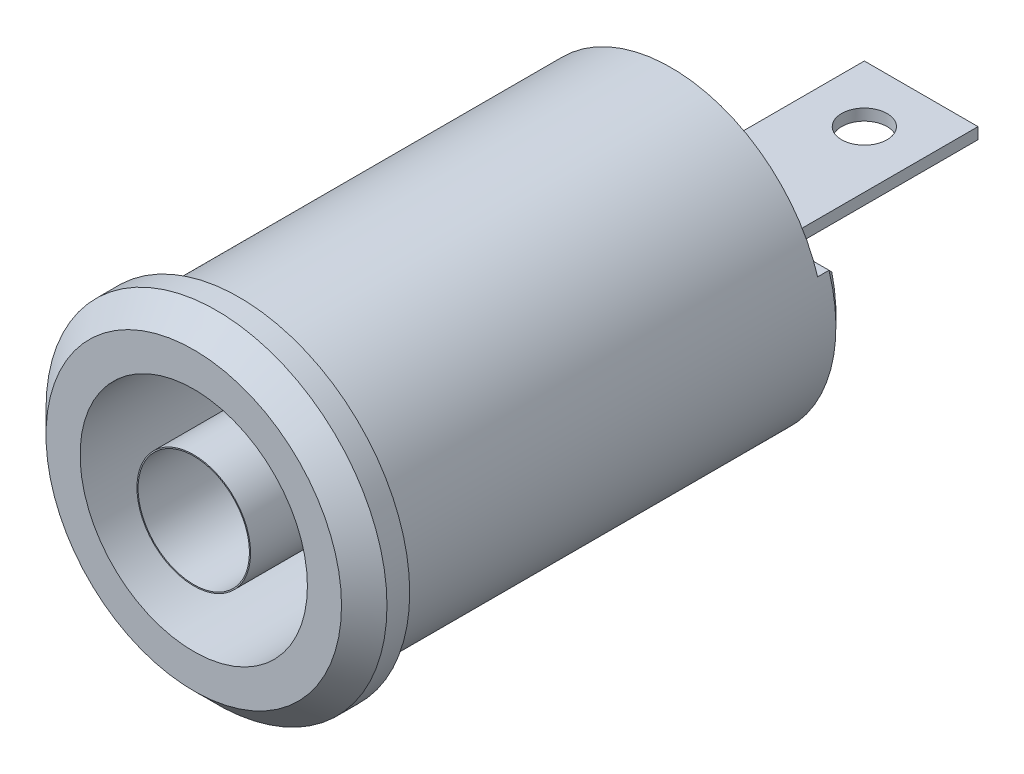
ISO-10303-21;
HEADER;
FILE_DESCRIPTION(('STEP AP214'),'2;1');
FILE_NAME('part.step','',(''),(''),'','','');
FILE_SCHEMA(('AUTOMOTIVE_DESIGN { 1 0 10303 214 1 1 1 1 }'));
ENDSEC;
DATA;
#1=APPLICATION_CONTEXT('core data for automotive mechanical design processes');
#2=APPLICATION_PROTOCOL_DEFINITION('international standard','automotive_design',2000,#1);
#3=PRODUCT_CONTEXT('',#1,'mechanical');
#4=PRODUCT('Part','Part','',(#3));
#5=PRODUCT_RELATED_PRODUCT_CATEGORY('part','',(#4));
#6=PRODUCT_DEFINITION_FORMATION('','',#4);
#7=PRODUCT_DEFINITION_CONTEXT('part definition',#1,'design');
#8=PRODUCT_DEFINITION('design','',#6,#7);
#9=PRODUCT_DEFINITION_SHAPE('','',#8);
#10=(LENGTH_UNIT() NAMED_UNIT(*) SI_UNIT(.MILLI.,.METRE.));
#11=(NAMED_UNIT(*) PLANE_ANGLE_UNIT() SI_UNIT($,.RADIAN.));
#12=(NAMED_UNIT(*) SI_UNIT($,.STERADIAN.) SOLID_ANGLE_UNIT());
#13=UNCERTAINTY_MEASURE_WITH_UNIT(LENGTH_MEASURE(1.E-05),#10,'distance_accuracy_value','');
#14=(GEOMETRIC_REPRESENTATION_CONTEXT(3) GLOBAL_UNCERTAINTY_ASSIGNED_CONTEXT((#13)) GLOBAL_UNIT_ASSIGNED_CONTEXT((#10,
#11,#12)) REPRESENTATION_CONTEXT('',''));
#15=CARTESIAN_POINT('',(0.,0.,0.));
#16=DIRECTION('',(0.,0.,1.));
#17=DIRECTION('',(1.,0.,0.));
#18=AXIS2_PLACEMENT_3D('',#15,#16,#17);
#19=CARTESIAN_POINT('',(0.,0.,-2.));
#20=DIRECTION('',(0.,0.,-1.));
#21=DIRECTION('',(-1.,0.,0.));
#22=AXIS2_PLACEMENT_3D('',#19,#20,#21);
#23=CYLINDRICAL_SURFACE('',#22,6.75);
#24=DIRECTION('',(0.,0.,-1.));
#25=VECTOR('',#24,1.);
#26=CARTESIAN_POINT('',(-6.44689847911381,2.,-2.));
#27=LINE('',#26,#25);
#28=CARTESIAN_POINT('',(-6.44689847911381,2.,-21.5));
#29=VERTEX_POINT('',#28);
#30=CARTESIAN_POINT('',(-6.44689847911381,2.,-21.));
#31=VERTEX_POINT('',#30);
#32=EDGE_CURVE('E116',#29,#31,#27,.F.);
#33=ORIENTED_EDGE('',*,*,#32,.F.);
#34=CARTESIAN_POINT('',(0.,0.,-21.5));
#35=DIRECTION('',(0.,0.,-1.));
#36=DIRECTION('',(-1.,0.,0.));
#37=AXIS2_PLACEMENT_3D('',#34,#35,#36);
#38=CIRCLE('',#37,6.75);
#39=CARTESIAN_POINT('',(6.44689847911381,2.,-21.5));
#40=VERTEX_POINT('',#39);
#41=EDGE_CURVE('E121',#29,#40,#38,.F.);
#42=ORIENTED_EDGE('',*,*,#41,.T.);
#43=DIRECTION('',(0.,0.,-1.));
#44=VECTOR('',#43,1.);
#45=CARTESIAN_POINT('',(6.44689847911381,2.,-2.));
#46=LINE('',#45,#44);
#47=CARTESIAN_POINT('',(6.44689847911381,2.,-21.));
#48=VERTEX_POINT('',#47);
#49=EDGE_CURVE('E115',#48,#40,#46,.T.);
#50=ORIENTED_EDGE('',*,*,#49,.F.);
#51=CARTESIAN_POINT('',(0.,0.,-21.));
#52=DIRECTION('',(0.,0.,-1.));
#53=DIRECTION('',(-1.,0.,0.));
#54=AXIS2_PLACEMENT_3D('',#51,#52,#53);
#55=CIRCLE('',#54,6.75);
#56=EDGE_CURVE('E102',#48,#31,#55,.F.);
#57=ORIENTED_EDGE('',*,*,#56,.T.);
#58=EDGE_LOOP('',(#33,#42,#50,#57));
#59=FACE_BOUND('',#58,.T.);
#60=CARTESIAN_POINT('',(0.,0.,-2.));
#61=DIRECTION('',(0.,0.,-1.));
#62=DIRECTION('',(-1.,0.,0.));
#63=AXIS2_PLACEMENT_3D('',#60,#61,#62);
#64=CIRCLE('',#63,6.75);
#65=CARTESIAN_POINT('',(-6.75,0.,-2.));
#66=VERTEX_POINT('',#65);
#67=EDGE_CURVE('E153',#66,#66,#64,.T.);
#68=ORIENTED_EDGE('',*,*,#67,.T.);
#69=EDGE_LOOP('',(#68));
#70=FACE_BOUND('',#69,.T.);
#71=ADVANCED_FACE('F38',(#59,#70),#23,.T.);
#72=CARTESIAN_POINT('',(0.,0.,-32.));
#73=DIRECTION('',(0.,0.,1.));
#74=DIRECTION('',(1.,0.,0.));
#75=AXIS2_PLACEMENT_3D('',#72,#73,#74);
#76=CYLINDRICAL_SURFACE('',#75,7.5);
#77=CARTESIAN_POINT('',(0.,0.,-1.));
#78=DIRECTION('',(0.,0.,1.));
#79=DIRECTION('',(1.,0.,0.));
#80=AXIS2_PLACEMENT_3D('',#77,#78,#79);
#81=CIRCLE('',#80,7.5);
#82=CARTESIAN_POINT('',(7.5,0.,-1.));
#83=VERTEX_POINT('',#82);
#84=EDGE_CURVE('E187',#83,#83,#81,.F.);
#85=ORIENTED_EDGE('',*,*,#84,.T.);
#86=EDGE_LOOP('',(#85));
#87=FACE_BOUND('',#86,.T.);
#88=CARTESIAN_POINT('',(0.,0.,-2.));
#89=DIRECTION('',(0.,0.,-1.));
#90=DIRECTION('',(-1.,0.,0.));
#91=AXIS2_PLACEMENT_3D('',#88,#89,#90);
#92=CIRCLE('',#91,7.5);
#93=CARTESIAN_POINT('',(-7.5,0.,-2.));
#94=VERTEX_POINT('',#93);
#95=EDGE_CURVE('E162',#94,#94,#92,.F.);
#96=ORIENTED_EDGE('',*,*,#95,.T.);
#97=EDGE_LOOP('',(#96));
#98=FACE_BOUND('',#97,.T.);
#99=ADVANCED_FACE('F207',(#87,#98),#76,.T.);
#100=CARTESIAN_POINT('',(0.,0.,0.));
#101=DIRECTION('',(0.,0.,1.));
#102=DIRECTION('',(1.,0.,0.));
#103=AXIS2_PLACEMENT_3D('',#100,#101,#102);
#104=PLANE('',#103);
#105=CARTESIAN_POINT('',(0.,0.,0.));
#106=DIRECTION('',(0.,0.,1.));
#107=DIRECTION('',(1.,0.,0.));
#108=AXIS2_PLACEMENT_3D('',#105,#106,#107);
#109=CIRCLE('',#108,6.5);
#110=CARTESIAN_POINT('',(6.5,0.,0.));
#111=VERTEX_POINT('',#110);
#112=EDGE_CURVE('E109',#111,#111,#109,.T.);
#113=ORIENTED_EDGE('',*,*,#112,.T.);
#114=EDGE_LOOP('',(#113));
#115=FACE_BOUND('',#114,.T.);
#116=CARTESIAN_POINT('',(0.,0.,0.));
#117=DIRECTION('',(0.,0.,1.));
#118=DIRECTION('',(1.,0.,0.));
#119=AXIS2_PLACEMENT_3D('',#116,#117,#118);
#120=CIRCLE('',#119,5.);
#121=CARTESIAN_POINT('',(5.,0.,0.));
#122=VERTEX_POINT('',#121);
#123=EDGE_CURVE('E173',#122,#122,#120,.T.);
#124=ORIENTED_EDGE('',*,*,#123,.F.);
#125=EDGE_LOOP('',(#124));
#126=FACE_BOUND('',#125,.T.);
#127=ADVANCED_FACE('F210',(#115,#126),#104,.T.);
#128=CARTESIAN_POINT('',(0.,0.,-18.));
#129=DIRECTION('',(0.,0.,1.));
#130=DIRECTION('',(1.,0.,0.));
#131=AXIS2_PLACEMENT_3D('',#128,#129,#130);
#132=CYLINDRICAL_SURFACE('',#131,2.5);
#133=CARTESIAN_POINT('',(0.,0.,-18.));
#134=DIRECTION('',(0.,0.,1.));
#135=DIRECTION('',(1.,0.,0.));
#136=AXIS2_PLACEMENT_3D('',#133,#134,#135);
#137=CIRCLE('',#136,2.5);
#138=CARTESIAN_POINT('',(2.5,0.,-18.));
#139=VERTEX_POINT('',#138);
#140=EDGE_CURVE('E170',#139,#139,#137,.T.);
#141=ORIENTED_EDGE('',*,*,#140,.T.);
#142=EDGE_LOOP('',(#141));
#143=FACE_BOUND('',#142,.T.);
#144=CARTESIAN_POINT('',(0.,0.,0.));
#145=DIRECTION('',(0.,0.,1.));
#146=DIRECTION('',(1.,0.,0.));
#147=AXIS2_PLACEMENT_3D('',#144,#145,#146);
#148=CIRCLE('',#147,2.5);
#149=CARTESIAN_POINT('',(2.5,0.,0.));
#150=VERTEX_POINT('',#149);
#151=EDGE_CURVE('E166',#150,#150,#148,.T.);
#152=ORIENTED_EDGE('',*,*,#151,.F.);
#153=EDGE_LOOP('',(#152));
#154=FACE_BOUND('',#153,.T.);
#155=ADVANCED_FACE('F214',(#143,#154),#132,.T.);
#156=CARTESIAN_POINT('',(0.,0.,-18.));
#157=DIRECTION('',(0.,0.,1.));
#158=DIRECTION('',(1.,0.,0.));
#159=AXIS2_PLACEMENT_3D('',#156,#157,#158);
#160=CYLINDRICAL_SURFACE('',#159,5.);
#161=CARTESIAN_POINT('',(0.,0.,-18.));
#162=DIRECTION('',(0.,0.,1.));
#163=DIRECTION('',(1.,0.,0.));
#164=AXIS2_PLACEMENT_3D('',#161,#162,#163);
#165=CIRCLE('',#164,5.);
#166=CARTESIAN_POINT('',(5.,0.,-18.));
#167=VERTEX_POINT('',#166);
#168=EDGE_CURVE('E110',#167,#167,#165,.T.);
#169=ORIENTED_EDGE('',*,*,#168,.F.);
#170=EDGE_LOOP('',(#169));
#171=FACE_BOUND('',#170,.T.);
#172=ORIENTED_EDGE('',*,*,#123,.T.);
#173=EDGE_LOOP('',(#172));
#174=FACE_BOUND('',#173,.T.);
#175=ADVANCED_FACE('F224',(#171,#174),#160,.F.);
#176=CARTESIAN_POINT('',(0.,-16.6414213562373,-18.));
#177=DIRECTION('',(0.,0.,1.));
#178=DIRECTION('',(1.,0.,0.));
#179=AXIS2_PLACEMENT_3D('',#176,#177,#178);
#180=PLANE('',#179);
#181=ORIENTED_EDGE('',*,*,#140,.F.);
#182=EDGE_LOOP('',(#181));
#183=FACE_BOUND('',#182,.T.);
#184=ORIENTED_EDGE('',*,*,#168,.T.);
#185=EDGE_LOOP('',(#184));
#186=FACE_BOUND('',#185,.T.);
#187=ADVANCED_FACE('F228',(#183,#186),#180,.T.);
#188=CARTESIAN_POINT('',(0.,0.,0.));
#189=DIRECTION('',(0.,0.,1.));
#190=DIRECTION('',(1.,0.,0.));
#191=AXIS2_PLACEMENT_3D('',#188,#189,#190);
#192=CIRCLE('',#191,2.45);
#193=CARTESIAN_POINT('',(2.45,0.,0.));
#194=VERTEX_POINT('',#193);
#195=EDGE_CURVE('E167',#194,#194,#192,.T.);
#196=ORIENTED_EDGE('',*,*,#195,.F.);
#197=EDGE_LOOP('',(#196));
#198=FACE_BOUND('',#197,.T.);
#199=ORIENTED_EDGE('',*,*,#151,.T.);
#200=EDGE_LOOP('',(#199));
#201=FACE_BOUND('',#200,.T.);
#202=ADVANCED_FACE('F216',(#198,#201),#104,.T.);
#203=CARTESIAN_POINT('',(0.,0.,-18.));
#204=DIRECTION('',(0.,0.,1.));
#205=DIRECTION('',(1.,0.,0.));
#206=AXIS2_PLACEMENT_3D('',#203,#204,#205);
#207=CYLINDRICAL_SURFACE('',#206,2.45);
#208=CARTESIAN_POINT('',(0.,0.,-18.));
#209=DIRECTION('',(0.,0.,1.));
#210=DIRECTION('',(1.,0.,0.));
#211=AXIS2_PLACEMENT_3D('',#208,#209,#210);
#212=CIRCLE('',#211,2.45);
#213=CARTESIAN_POINT('',(2.45,0.,-18.));
#214=VERTEX_POINT('',#213);
#215=EDGE_CURVE('E163',#214,#214,#212,.T.);
#216=ORIENTED_EDGE('',*,*,#215,.F.);
#217=EDGE_LOOP('',(#216));
#218=FACE_BOUND('',#217,.T.);
#219=ORIENTED_EDGE('',*,*,#195,.T.);
#220=EDGE_LOOP('',(#219));
#221=FACE_BOUND('',#220,.T.);
#222=ADVANCED_FACE('F233',(#218,#221),#207,.F.);
#223=CARTESIAN_POINT('',(0.,-16.6414213562373,-18.));
#224=DIRECTION('',(0.,0.,1.));
#225=DIRECTION('',(1.,0.,0.));
#226=AXIS2_PLACEMENT_3D('',#223,#224,#225);
#227=PLANE('',#226);
#228=ORIENTED_EDGE('',*,*,#215,.T.);
#229=EDGE_LOOP('',(#228));
#230=FACE_BOUND('',#229,.T.);
#231=ADVANCED_FACE('F236',(#230),#227,.T.);
#232=CARTESIAN_POINT('',(0.,0.,-2.));
#233=DIRECTION('',(0.,0.,-1.));
#234=DIRECTION('',(-1.,0.,0.));
#235=AXIS2_PLACEMENT_3D('',#232,#233,#234);
#236=PLANE('',#235);
#237=ORIENTED_EDGE('',*,*,#95,.F.);
#238=EDGE_LOOP('',(#237));
#239=FACE_BOUND('',#238,.T.);
#240=ORIENTED_EDGE('',*,*,#67,.F.);
#241=EDGE_LOOP('',(#240));
#242=FACE_BOUND('',#241,.T.);
#243=ADVANCED_FACE('F240',(#239,#242),#236,.T.);
#244=CARTESIAN_POINT('',(-0.025564170509286,-0.127820852546322,-22.));
#245=DIRECTION('',(0.,0.,-1.));
#246=DIRECTION('',(-1.,0.,0.));
#247=AXIS2_PLACEMENT_3D('',#244,#245,#246);
#248=PLANE('',#247);
#249=DIRECTION('',(1.,0.,0.));
#250=VECTOR('',#249,1.);
#251=CARTESIAN_POINT('',(6.44689847911381,1.5,-22.));
#252=LINE('',#251,#250);
#253=CARTESIAN_POINT('',(-6.0673305497558,1.5,-22.));
#254=VERTEX_POINT('',#253);
#255=CARTESIAN_POINT('',(6.0673305497558,1.5,-22.));
#256=VERTEX_POINT('',#255);
#257=EDGE_CURVE('E58',#254,#256,#252,.T.);
#258=ORIENTED_EDGE('',*,*,#257,.T.);
#259=CARTESIAN_POINT('',(0.,0.,-22.));
#260=DIRECTION('',(0.,0.,-1.));
#261=DIRECTION('',(-1.,0.,0.));
#262=AXIS2_PLACEMENT_3D('',#259,#260,#261);
#263=CIRCLE('',#262,6.25);
#264=EDGE_CURVE('E51',#256,#254,#263,.T.);
#265=ORIENTED_EDGE('',*,*,#264,.T.);
#266=EDGE_LOOP('',(#258,#265));
#267=FACE_BOUND('',#266,.T.);
#268=DIRECTION('',(1.,0.,0.));
#269=VECTOR('',#268,1.);
#270=CARTESIAN_POINT('',(2.5,0.249999999999999,-22.));
#271=LINE('',#270,#269);
#272=CARTESIAN_POINT('',(-2.5,0.249999999999999,-22.));
#273=VERTEX_POINT('',#272);
#274=CARTESIAN_POINT('',(2.5,0.249999999999999,-22.));
#275=VERTEX_POINT('',#274);
#276=EDGE_CURVE('E137',#273,#275,#271,.T.);
#277=ORIENTED_EDGE('',*,*,#276,.F.);
#278=DIRECTION('',(0.,1.,0.));
#279=VECTOR('',#278,1.);
#280=CARTESIAN_POINT('',(-2.5,0.249999999999999,-22.));
#281=LINE('',#280,#279);
#282=CARTESIAN_POINT('',(-2.5,-0.250000000000001,-22.));
#283=VERTEX_POINT('',#282);
#284=EDGE_CURVE('E134',#283,#273,#281,.T.);
#285=ORIENTED_EDGE('',*,*,#284,.F.);
#286=DIRECTION('',(-1.,0.,0.));
#287=VECTOR('',#286,1.);
#288=CARTESIAN_POINT('',(2.5,-0.250000000000001,-22.));
#289=LINE('',#288,#287);
#290=CARTESIAN_POINT('',(2.5,-0.250000000000001,-22.));
#291=VERTEX_POINT('',#290);
#292=EDGE_CURVE('E130',#291,#283,#289,.T.);
#293=ORIENTED_EDGE('',*,*,#292,.F.);
#294=DIRECTION('',(0.,-1.,0.));
#295=VECTOR('',#294,1.);
#296=CARTESIAN_POINT('',(2.5,0.249999999999999,-22.));
#297=LINE('',#296,#295);
#298=EDGE_CURVE('E127',#275,#291,#297,.T.);
#299=ORIENTED_EDGE('',*,*,#298,.F.);
#300=EDGE_LOOP('',(#277,#285,#293,#299));
#301=FACE_BOUND('',#300,.T.);
#302=ADVANCED_FACE('F244',(#267,#301),#248,.T.);
#303=CARTESIAN_POINT('',(2.5,0.249999999999999,-22.));
#304=DIRECTION('',(1.,0.,0.));
#305=DIRECTION('',(0.,0.,-1.));
#306=AXIS2_PLACEMENT_3D('',#303,#304,#305);
#307=PLANE('',#306);
#308=DIRECTION('',(0.,-1.,0.));
#309=VECTOR('',#308,1.);
#310=CARTESIAN_POINT('',(2.5,0.249999999999999,-32.));
#311=LINE('',#310,#309);
#312=CARTESIAN_POINT('',(2.5,0.249999999999999,-32.));
#313=VERTEX_POINT('',#312);
#314=CARTESIAN_POINT('',(2.5,-0.250000000000001,-32.));
#315=VERTEX_POINT('',#314);
#316=EDGE_CURVE('E123',#313,#315,#311,.T.);
#317=ORIENTED_EDGE('',*,*,#316,.F.);
#318=DIRECTION('',(0.,0.,-1.));
#319=VECTOR('',#318,1.);
#320=CARTESIAN_POINT('',(2.5,0.249999999999999,-22.));
#321=LINE('',#320,#319);
#322=EDGE_CURVE('E151',#275,#313,#321,.T.);
#323=ORIENTED_EDGE('',*,*,#322,.F.);
#324=ORIENTED_EDGE('',*,*,#298,.T.);
#325=DIRECTION('',(0.,0.,-1.));
#326=VECTOR('',#325,1.);
#327=CARTESIAN_POINT('',(2.5,-0.250000000000001,-22.));
#328=LINE('',#327,#326);
#329=EDGE_CURVE('E140',#291,#315,#328,.T.);
#330=ORIENTED_EDGE('',*,*,#329,.T.);
#331=EDGE_LOOP('',(#317,#323,#324,#330));
#332=FACE_BOUND('',#331,.T.);
#333=ADVANCED_FACE('F250',(#332),#307,.T.);
#334=CARTESIAN_POINT('',(2.5,0.249999999999999,-22.));
#335=DIRECTION('',(0.,1.,0.));
#336=DIRECTION('',(0.,0.,1.));
#337=AXIS2_PLACEMENT_3D('',#334,#335,#336);
#338=PLANE('',#337);
#339=CARTESIAN_POINT('',(0.,0.249999999999999,-29.5));
#340=DIRECTION('',(0.,1.,0.));
#341=DIRECTION('',(0.,0.,1.));
#342=AXIS2_PLACEMENT_3D('',#339,#340,#341);
#343=CIRCLE('',#342,1.);
#344=CARTESIAN_POINT('',(0.,0.249999999999999,-28.5));
#345=VERTEX_POINT('',#344);
#346=EDGE_CURVE('E184',#345,#345,#343,.T.);
#347=ORIENTED_EDGE('',*,*,#346,.F.);
#348=EDGE_LOOP('',(#347));
#349=FACE_BOUND('',#348,.T.);
#350=DIRECTION('',(1.,0.,0.));
#351=VECTOR('',#350,1.);
#352=CARTESIAN_POINT('',(2.5,0.249999999999999,-32.));
#353=LINE('',#352,#351);
#354=CARTESIAN_POINT('',(-2.5,0.249999999999999,-32.));
#355=VERTEX_POINT('',#354);
#356=EDGE_CURVE('E131',#355,#313,#353,.T.);
#357=ORIENTED_EDGE('',*,*,#356,.F.);
#358=DIRECTION('',(0.,0.,-1.));
#359=VECTOR('',#358,1.);
#360=CARTESIAN_POINT('',(-2.5,0.249999999999999,-22.));
#361=LINE('',#360,#359);
#362=EDGE_CURVE('E154',#273,#355,#361,.T.);
#363=ORIENTED_EDGE('',*,*,#362,.F.);
#364=ORIENTED_EDGE('',*,*,#276,.T.);
#365=ORIENTED_EDGE('',*,*,#322,.T.);
#366=EDGE_LOOP('',(#357,#363,#364,#365));
#367=FACE_BOUND('',#366,.T.);
#368=ADVANCED_FACE('F253',(#349,#367),#338,.T.);
#369=CARTESIAN_POINT('',(-2.5,0.249999999999999,-22.));
#370=DIRECTION('',(-1.,0.,0.));
#371=DIRECTION('',(0.,-1.,0.));
#372=AXIS2_PLACEMENT_3D('',#369,#370,#371);
#373=PLANE('',#372);
#374=DIRECTION('',(0.,1.,0.));
#375=VECTOR('',#374,1.);
#376=CARTESIAN_POINT('',(-2.5,0.249999999999999,-32.));
#377=LINE('',#376,#375);
#378=CARTESIAN_POINT('',(-2.5,-0.250000000000001,-32.));
#379=VERTEX_POINT('',#378);
#380=EDGE_CURVE('E146',#379,#355,#377,.T.);
#381=ORIENTED_EDGE('',*,*,#380,.F.);
#382=DIRECTION('',(0.,0.,-1.));
#383=VECTOR('',#382,1.);
#384=CARTESIAN_POINT('',(-2.5,-0.250000000000001,-22.));
#385=LINE('',#384,#383);
#386=EDGE_CURVE('E156',#283,#379,#385,.T.);
#387=ORIENTED_EDGE('',*,*,#386,.F.);
#388=ORIENTED_EDGE('',*,*,#284,.T.);
#389=ORIENTED_EDGE('',*,*,#362,.T.);
#390=EDGE_LOOP('',(#381,#387,#388,#389));
#391=FACE_BOUND('',#390,.T.);
#392=ADVANCED_FACE('F257',(#391),#373,.T.);
#393=CARTESIAN_POINT('',(2.5,-0.250000000000001,-22.));
#394=DIRECTION('',(0.,-1.,0.));
#395=DIRECTION('',(0.,0.,-1.));
#396=AXIS2_PLACEMENT_3D('',#393,#394,#395);
#397=PLANE('',#396);
#398=CARTESIAN_POINT('',(0.,-0.250000000000001,-29.5));
#399=DIRECTION('',(0.,-1.,0.));
#400=DIRECTION('',(0.,0.,-1.));
#401=AXIS2_PLACEMENT_3D('',#398,#399,#400);
#402=CIRCLE('',#401,1.);
#403=CARTESIAN_POINT('',(0.,-0.250000000000001,-30.5));
#404=VERTEX_POINT('',#403);
#405=EDGE_CURVE('E117',#404,#404,#402,.T.);
#406=ORIENTED_EDGE('',*,*,#405,.F.);
#407=EDGE_LOOP('',(#406));
#408=FACE_BOUND('',#407,.T.);
#409=DIRECTION('',(-1.,0.,0.));
#410=VECTOR('',#409,1.);
#411=CARTESIAN_POINT('',(2.5,-0.250000000000001,-32.));
#412=LINE('',#411,#410);
#413=EDGE_CURVE('E143',#315,#379,#412,.T.);
#414=ORIENTED_EDGE('',*,*,#413,.F.);
#415=ORIENTED_EDGE('',*,*,#329,.F.);
#416=ORIENTED_EDGE('',*,*,#292,.T.);
#417=ORIENTED_EDGE('',*,*,#386,.T.);
#418=EDGE_LOOP('',(#414,#415,#416,#417));
#419=FACE_BOUND('',#418,.T.);
#420=ADVANCED_FACE('F220',(#408,#419),#397,.T.);
#421=CARTESIAN_POINT('',(0.,0.,-32.));
#422=DIRECTION('',(0.,0.,1.));
#423=DIRECTION('',(1.,0.,0.));
#424=AXIS2_PLACEMENT_3D('',#421,#422,#423);
#425=PLANE('',#424);
#426=ORIENTED_EDGE('',*,*,#316,.T.);
#427=ORIENTED_EDGE('',*,*,#413,.T.);
#428=ORIENTED_EDGE('',*,*,#380,.T.);
#429=ORIENTED_EDGE('',*,*,#356,.T.);
#430=EDGE_LOOP('',(#426,#427,#428,#429));
#431=FACE_BOUND('',#430,.T.);
#432=ADVANCED_FACE('F217',(#431),#425,.F.);
#433=CARTESIAN_POINT('',(9.,2.,-21.));
#434=DIRECTION('',(0.,-1.,0.));
#435=DIRECTION('',(0.,0.,-1.));
#436=AXIS2_PLACEMENT_3D('',#433,#434,#435);
#437=PLANE('',#436);
#438=ORIENTED_EDGE('',*,*,#49,.T.);
#439=DIRECTION('',(-1.,0.,0.));
#440=VECTOR('',#439,1.);
#441=CARTESIAN_POINT('',(-6.44689847911381,2.,-21.5));
#442=LINE('',#441,#440);
#443=EDGE_CURVE('E13',#40,#29,#442,.T.);
#444=ORIENTED_EDGE('',*,*,#443,.T.);
#445=ORIENTED_EDGE('',*,*,#32,.T.);
#446=DIRECTION('',(-1.,0.,0.));
#447=VECTOR('',#446,1.);
#448=CARTESIAN_POINT('',(9.,2.,-21.));
#449=LINE('',#448,#447);
#450=EDGE_CURVE('E105',#48,#31,#449,.T.);
#451=ORIENTED_EDGE('',*,*,#450,.F.);
#452=EDGE_LOOP('',(#438,#444,#445,#451));
#453=FACE_BOUND('',#452,.T.);
#454=ADVANCED_FACE('F114',(#453),#437,.F.);
#455=CARTESIAN_POINT('',(9.,2.,-21.));
#456=DIRECTION('',(0.,0.,-1.));
#457=DIRECTION('',(-1.,0.,0.));
#458=AXIS2_PLACEMENT_3D('',#455,#456,#457);
#459=PLANE('',#458);
#460=ORIENTED_EDGE('',*,*,#450,.T.);
#461=ORIENTED_EDGE('',*,*,#56,.F.);
#462=EDGE_LOOP('',(#460,#461));
#463=FACE_BOUND('',#462,.T.);
#464=ADVANCED_FACE('F104',(#463),#459,.T.);
#465=CARTESIAN_POINT('',(0.,-7.5,-29.5));
#466=DIRECTION('',(0.,1.,0.));
#467=DIRECTION('',(0.,0.,1.));
#468=AXIS2_PLACEMENT_3D('',#465,#466,#467);
#469=CYLINDRICAL_SURFACE('',#468,1.);
#470=ORIENTED_EDGE('',*,*,#405,.T.);
#471=EDGE_LOOP('',(#470));
#472=FACE_BOUND('',#471,.T.);
#473=ORIENTED_EDGE('',*,*,#346,.T.);
#474=EDGE_LOOP('',(#473));
#475=FACE_BOUND('',#474,.T.);
#476=ADVANCED_FACE('F205',(#472,#475),#469,.F.);
#477=CARTESIAN_POINT('',(0.,0.,0.));
#478=DIRECTION('',(0.,0.,-1.));
#479=DIRECTION('',(-1.,0.,0.));
#480=AXIS2_PLACEMENT_3D('',#477,#478,#479);
#481=CONICAL_SURFACE('',#480,6.5,0.785398163397447);
#482=ORIENTED_EDGE('',*,*,#84,.F.);
#483=EDGE_LOOP('',(#482));
#484=FACE_BOUND('',#483,.T.);
#485=ORIENTED_EDGE('',*,*,#112,.F.);
#486=EDGE_LOOP('',(#485));
#487=FACE_BOUND('',#486,.T.);
#488=ADVANCED_FACE('F200',(#484,#487),#481,.T.);
#489=CARTESIAN_POINT('',(9.,2.,-21.5));
#490=DIRECTION('',(0.,0.707106781186545,-0.70710678118655));
#491=DIRECTION('',(0.,0.70710678118655,0.707106781186545));
#492=AXIS2_PLACEMENT_3D('',#489,#490,#491);
#493=PLANE('',#492);
#494=CARTESIAN_POINT('',(6.44689847911381,2.,-21.5));
#495=CARTESIAN_POINT('',(6.3851266107469,1.91610148293892,-21.5838985170611));
#496=CARTESIAN_POINT('',(6.32261006552449,1.83248562132334,-21.6675143786767));
#497=CARTESIAN_POINT('',(6.19608742698162,1.66581895291959,-21.8341810470804));
#498=CARTESIAN_POINT('',(6.13208132908472,1.5827681478685,-21.9172318521315));
#499=CARTESIAN_POINT('',(6.06733054975587,1.49999999999997,-22.));
#500=B_SPLINE_CURVE_WITH_KNOTS('',3,(#494,#495,#496,#497,#498,#499),.UNSPECIFIED.,.F.,.F.,(4,2,
4),(0.,0.401277818332635,0.802556869698785),.UNSPECIFIED.);
#501=EDGE_CURVE('E192',#256,#40,#500,.F.);
#502=ORIENTED_EDGE('',*,*,#501,.F.);
#503=ORIENTED_EDGE('',*,*,#257,.F.);
#504=CARTESIAN_POINT('',(-6.0673305497558,1.5,-22.));
#505=CARTESIAN_POINT('',(-6.13208132908466,1.58276814786852,-21.9172318521315));
#506=CARTESIAN_POINT('',(-6.19608742698158,1.66581895291961,-21.8341810470804));
#507=CARTESIAN_POINT('',(-6.32261006552452,1.83248562132333,-21.6675143786767));
#508=CARTESIAN_POINT('',(-6.38512661074698,1.91610148293889,-21.5838985170611));
#509=CARTESIAN_POINT('',(-6.44689847911395,1.99999999999995,-21.5000000000001));
#510=B_SPLINE_CURVE_WITH_KNOTS('',3,(#504,#505,#506,#507,#508,#509),.UNSPECIFIED.,.F.,.F.,(4,2,
4),(0.,0.40127905136615,0.802556869698785),.UNSPECIFIED.);
#511=EDGE_CURVE('E43',#29,#254,#510,.F.);
#512=ORIENTED_EDGE('',*,*,#511,.F.);
#513=ORIENTED_EDGE('',*,*,#443,.F.);
#514=EDGE_LOOP('',(#502,#503,#512,#513));
#515=FACE_BOUND('',#514,.T.);
#516=ADVANCED_FACE('F196',(#515),#493,.T.);
#517=CARTESIAN_POINT('',(0.,0.,-21.5));
#518=DIRECTION('',(0.,0.,1.));
#519=DIRECTION('',(1.,0.,0.));
#520=AXIS2_PLACEMENT_3D('',#517,#518,#519);
#521=CONICAL_SURFACE('',#520,6.75,0.785398163397452);
#522=ORIENTED_EDGE('',*,*,#511,.T.);
#523=ORIENTED_EDGE('',*,*,#264,.F.);
#524=ORIENTED_EDGE('',*,*,#501,.T.);
#525=ORIENTED_EDGE('',*,*,#41,.F.);
#526=EDGE_LOOP('',(#522,#523,#524,#525));
#527=FACE_BOUND('',#526,.T.);
#528=ADVANCED_FACE('F40',(#527),#521,.T.);
#529=CLOSED_SHELL('',(#71,#99,#127,#155,#175,#187,#202,#222,#231,#243,#302,#333,#368,#392,#420,
#432,#454,#464,#476,#488,#516,#528));
#530=MANIFOLD_SOLID_BREP('B2',#529);
#531=ADVANCED_BREP_SHAPE_REPRESENTATION('',(#18,#530),#14);
#532=SHAPE_DEFINITION_REPRESENTATION(#9,#531);
ENDSEC;
END-ISO-10303-21;
